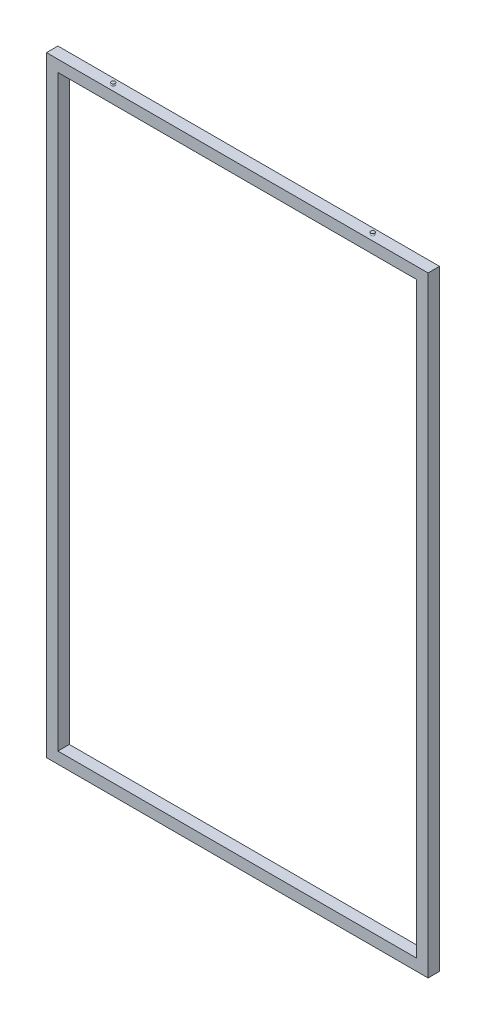
ISO-10303-21;
HEADER;
FILE_DESCRIPTION(('STEP AP214'),'2;1');
FILE_NAME('part.step','',(''),(''),'','','');
FILE_SCHEMA(('AUTOMOTIVE_DESIGN { 1 0 10303 214 1 1 1 1 }'));
ENDSEC;
DATA;
#1=APPLICATION_CONTEXT('core data for automotive mechanical design processes');
#2=APPLICATION_PROTOCOL_DEFINITION('international standard','automotive_design',2000,#1);
#3=PRODUCT_CONTEXT('',#1,'mechanical');
#4=PRODUCT('Part','Part','',(#3));
#5=PRODUCT_RELATED_PRODUCT_CATEGORY('part','',(#4));
#6=PRODUCT_DEFINITION_FORMATION('','',#4);
#7=PRODUCT_DEFINITION_CONTEXT('part definition',#1,'design');
#8=PRODUCT_DEFINITION('design','',#6,#7);
#9=PRODUCT_DEFINITION_SHAPE('','',#8);
#10=(LENGTH_UNIT() NAMED_UNIT(*) SI_UNIT(.MILLI.,.METRE.));
#11=(NAMED_UNIT(*) PLANE_ANGLE_UNIT() SI_UNIT($,.RADIAN.));
#12=(NAMED_UNIT(*) SI_UNIT($,.STERADIAN.) SOLID_ANGLE_UNIT());
#13=UNCERTAINTY_MEASURE_WITH_UNIT(LENGTH_MEASURE(1.E-05),#10,'distance_accuracy_value','');
#14=(GEOMETRIC_REPRESENTATION_CONTEXT(3) GLOBAL_UNCERTAINTY_ASSIGNED_CONTEXT((#13)) GLOBAL_UNIT_ASSIGNED_CONTEXT((#10,
#11,#12)) REPRESENTATION_CONTEXT('',''));
#15=CARTESIAN_POINT('',(0.,0.,0.));
#16=DIRECTION('',(0.,0.,1.));
#17=DIRECTION('',(1.,0.,0.));
#18=AXIS2_PLACEMENT_3D('',#15,#16,#17);
#19=CARTESIAN_POINT('',(0.,0.,15.));
#20=DIRECTION('',(0.,0.,1.));
#21=DIRECTION('',(1.,0.,0.));
#22=AXIS2_PLACEMENT_3D('',#19,#20,#21);
#23=PLANE('',#22);
#24=DIRECTION('',(0.,1.,0.));
#25=VECTOR('',#24,1.);
#26=CARTESIAN_POINT('',(500.,800.,15.));
#27=LINE('',#26,#25);
#28=CARTESIAN_POINT('',(500.,-800.,15.));
#29=VERTEX_POINT('',#28);
#30=CARTESIAN_POINT('',(500.,800.,15.));
#31=VERTEX_POINT('',#30);
#32=EDGE_CURVE('E299',#29,#31,#27,.T.);
#33=ORIENTED_EDGE('',*,*,#32,.T.);
#34=DIRECTION('',(-1.,0.,0.));
#35=VECTOR('',#34,1.);
#36=CARTESIAN_POINT('',(-500.,800.,15.));
#37=LINE('',#36,#35);
#38=CARTESIAN_POINT('',(-500.,800.,15.));
#39=VERTEX_POINT('',#38);
#40=EDGE_CURVE('E302',#31,#39,#37,.T.);
#41=ORIENTED_EDGE('',*,*,#40,.T.);
#42=DIRECTION('',(0.,-1.,0.));
#43=VECTOR('',#42,1.);
#44=CARTESIAN_POINT('',(-500.,800.,15.));
#45=LINE('',#44,#43);
#46=CARTESIAN_POINT('',(-500.,-800.,15.));
#47=VERTEX_POINT('',#46);
#48=EDGE_CURVE('E305',#39,#47,#45,.T.);
#49=ORIENTED_EDGE('',*,*,#48,.T.);
#50=DIRECTION('',(1.,0.,0.));
#51=VECTOR('',#50,1.);
#52=CARTESIAN_POINT('',(-500.,-800.,15.));
#53=LINE('',#52,#51);
#54=EDGE_CURVE('E307',#47,#29,#53,.T.);
#55=ORIENTED_EDGE('',*,*,#54,.T.);
#56=EDGE_LOOP('',(#33,#41,#49,#55));
#57=FACE_BOUND('',#56,.T.);
#58=DIRECTION('',(1.,0.,0.));
#59=VECTOR('',#58,1.);
#60=CARTESIAN_POINT('',(-470.,-770.,15.));
#61=LINE('',#60,#59);
#62=CARTESIAN_POINT('',(-470.,-770.,15.));
#63=VERTEX_POINT('',#62);
#64=CARTESIAN_POINT('',(470.,-770.,15.));
#65=VERTEX_POINT('',#64);
#66=EDGE_CURVE('E277',#63,#65,#61,.T.);
#67=ORIENTED_EDGE('',*,*,#66,.F.);
#68=DIRECTION('',(0.,-1.,0.));
#69=VECTOR('',#68,1.);
#70=CARTESIAN_POINT('',(-470.,770.,15.));
#71=LINE('',#70,#69);
#72=CARTESIAN_POINT('',(-470.,770.,15.));
#73=VERTEX_POINT('',#72);
#74=EDGE_CURVE('E275',#73,#63,#71,.T.);
#75=ORIENTED_EDGE('',*,*,#74,.F.);
#76=DIRECTION('',(-1.,0.,0.));
#77=VECTOR('',#76,1.);
#78=CARTESIAN_POINT('',(-470.,770.,15.));
#79=LINE('',#78,#77);
#80=CARTESIAN_POINT('',(470.,770.,15.));
#81=VERTEX_POINT('',#80);
#82=EDGE_CURVE('E282',#81,#73,#79,.T.);
#83=ORIENTED_EDGE('',*,*,#82,.F.);
#84=DIRECTION('',(0.,1.,0.));
#85=VECTOR('',#84,1.);
#86=CARTESIAN_POINT('',(470.,770.,15.));
#87=LINE('',#86,#85);
#88=EDGE_CURVE('E280',#65,#81,#87,.T.);
#89=ORIENTED_EDGE('',*,*,#88,.F.);
#90=EDGE_LOOP('',(#67,#75,#83,#89));
#91=FACE_BOUND('',#90,.T.);
#92=ADVANCED_FACE('F36',(#57,#91),#23,.T.);
#93=CARTESIAN_POINT('',(0.,0.,-15.));
#94=DIRECTION('',(0.,0.,1.));
#95=DIRECTION('',(1.,0.,0.));
#96=AXIS2_PLACEMENT_3D('',#93,#94,#95);
#97=PLANE('',#96);
#98=DIRECTION('',(0.,1.,0.));
#99=VECTOR('',#98,1.);
#100=CARTESIAN_POINT('',(500.,800.,-15.));
#101=LINE('',#100,#99);
#102=CARTESIAN_POINT('',(500.,-800.,-15.));
#103=VERTEX_POINT('',#102);
#104=CARTESIAN_POINT('',(500.,800.,-15.));
#105=VERTEX_POINT('',#104);
#106=EDGE_CURVE('E298',#103,#105,#101,.T.);
#107=ORIENTED_EDGE('',*,*,#106,.F.);
#108=DIRECTION('',(1.,0.,0.));
#109=VECTOR('',#108,1.);
#110=CARTESIAN_POINT('',(-500.,-800.,-15.));
#111=LINE('',#110,#109);
#112=CARTESIAN_POINT('',(-500.,-800.,-15.));
#113=VERTEX_POINT('',#112);
#114=EDGE_CURVE('E303',#113,#103,#111,.T.);
#115=ORIENTED_EDGE('',*,*,#114,.F.);
#116=DIRECTION('',(0.,-1.,0.));
#117=VECTOR('',#116,1.);
#118=CARTESIAN_POINT('',(-500.,800.,-15.));
#119=LINE('',#118,#117);
#120=CARTESIAN_POINT('',(-500.,800.,-15.));
#121=VERTEX_POINT('',#120);
#122=EDGE_CURVE('E314',#121,#113,#119,.T.);
#123=ORIENTED_EDGE('',*,*,#122,.F.);
#124=DIRECTION('',(-1.,0.,0.));
#125=VECTOR('',#124,1.);
#126=CARTESIAN_POINT('',(-500.,800.,-15.));
#127=LINE('',#126,#125);
#128=EDGE_CURVE('E312',#105,#121,#127,.T.);
#129=ORIENTED_EDGE('',*,*,#128,.F.);
#130=EDGE_LOOP('',(#107,#115,#123,#129));
#131=FACE_BOUND('',#130,.T.);
#132=DIRECTION('',(0.,-1.,0.));
#133=VECTOR('',#132,1.);
#134=CARTESIAN_POINT('',(-470.,770.,-15.));
#135=LINE('',#134,#133);
#136=CARTESIAN_POINT('',(-470.,770.,-15.));
#137=VERTEX_POINT('',#136);
#138=CARTESIAN_POINT('',(-470.,-770.,-15.));
#139=VERTEX_POINT('',#138);
#140=EDGE_CURVE('E59',#137,#139,#135,.T.);
#141=ORIENTED_EDGE('',*,*,#140,.T.);
#142=DIRECTION('',(1.,0.,0.));
#143=VECTOR('',#142,1.);
#144=CARTESIAN_POINT('',(-470.,-770.,-15.));
#145=LINE('',#144,#143);
#146=CARTESIAN_POINT('',(470.,-770.,-15.));
#147=VERTEX_POINT('',#146);
#148=EDGE_CURVE('E203',#139,#147,#145,.T.);
#149=ORIENTED_EDGE('',*,*,#148,.T.);
#150=DIRECTION('',(0.,1.,0.));
#151=VECTOR('',#150,1.);
#152=CARTESIAN_POINT('',(470.,770.,-15.));
#153=LINE('',#152,#151);
#154=CARTESIAN_POINT('',(470.,770.,-15.));
#155=VERTEX_POINT('',#154);
#156=EDGE_CURVE('E287',#147,#155,#153,.T.);
#157=ORIENTED_EDGE('',*,*,#156,.T.);
#158=DIRECTION('',(-1.,0.,0.));
#159=VECTOR('',#158,1.);
#160=CARTESIAN_POINT('',(-470.,770.,-15.));
#161=LINE('',#160,#159);
#162=EDGE_CURVE('E278',#155,#137,#161,.T.);
#163=ORIENTED_EDGE('',*,*,#162,.T.);
#164=EDGE_LOOP('',(#141,#149,#157,#163));
#165=FACE_BOUND('',#164,.T.);
#166=ADVANCED_FACE('F332',(#131,#165),#97,.F.);
#167=CARTESIAN_POINT('',(500.,800.,15.));
#168=DIRECTION('',(-1.,0.,0.));
#169=DIRECTION('',(0.,-1.,0.));
#170=AXIS2_PLACEMENT_3D('',#167,#168,#169);
#171=PLANE('',#170);
#172=ORIENTED_EDGE('',*,*,#106,.T.);
#173=DIRECTION('',(0.,0.,-1.));
#174=VECTOR('',#173,1.);
#175=CARTESIAN_POINT('',(500.,800.,15.));
#176=LINE('',#175,#174);
#177=EDGE_CURVE('E11',#31,#105,#176,.T.);
#178=ORIENTED_EDGE('',*,*,#177,.F.);
#179=ORIENTED_EDGE('',*,*,#32,.F.);
#180=DIRECTION('',(0.,0.,-1.));
#181=VECTOR('',#180,1.);
#182=CARTESIAN_POINT('',(500.,-800.,15.));
#183=LINE('',#182,#181);
#184=EDGE_CURVE('E309',#29,#103,#183,.T.);
#185=ORIENTED_EDGE('',*,*,#184,.T.);
#186=EDGE_LOOP('',(#172,#178,#179,#185));
#187=FACE_BOUND('',#186,.T.);
#188=ADVANCED_FACE('F38',(#187),#171,.F.);
#189=CARTESIAN_POINT('',(-500.,800.,15.));
#190=DIRECTION('',(0.,-1.,0.));
#191=DIRECTION('',(0.,0.,-1.));
#192=AXIS2_PLACEMENT_3D('',#189,#190,#191);
#193=PLANE('',#192);
#194=CARTESIAN_POINT('',(340.,800.,0.));
#195=DIRECTION('',(0.,1.,0.));
#196=DIRECTION('',(0.,0.,-1.));
#197=AXIS2_PLACEMENT_3D('',#194,#195,#196);
#198=CIRCLE('',#197,5.);
#199=CARTESIAN_POINT('',(340.,800.,-5.));
#200=VERTEX_POINT('',#199);
#201=EDGE_CURVE('E474',#200,#200,#198,.T.);
#202=ORIENTED_EDGE('',*,*,#201,.F.);
#203=EDGE_LOOP('',(#202));
#204=FACE_BOUND('',#203,.T.);
#205=CARTESIAN_POINT('',(-340.,800.,0.));
#206=DIRECTION('',(0.,-1.,0.));
#207=DIRECTION('',(0.,0.,-1.));
#208=AXIS2_PLACEMENT_3D('',#205,#206,#207);
#209=CIRCLE('',#208,5.);
#210=CARTESIAN_POINT('',(-340.,800.,-5.));
#211=VERTEX_POINT('',#210);
#212=EDGE_CURVE('E478',#211,#211,#209,.T.);
#213=ORIENTED_EDGE('',*,*,#212,.T.);
#214=EDGE_LOOP('',(#213));
#215=FACE_BOUND('',#214,.T.);
#216=ORIENTED_EDGE('',*,*,#128,.T.);
#217=DIRECTION('',(0.,0.,-1.));
#218=VECTOR('',#217,1.);
#219=CARTESIAN_POINT('',(-500.,800.,15.));
#220=LINE('',#219,#218);
#221=EDGE_CURVE('E44',#39,#121,#220,.T.);
#222=ORIENTED_EDGE('',*,*,#221,.F.);
#223=ORIENTED_EDGE('',*,*,#40,.F.);
#224=ORIENTED_EDGE('',*,*,#177,.T.);
#225=EDGE_LOOP('',(#216,#222,#223,#224));
#226=FACE_BOUND('',#225,.T.);
#227=ADVANCED_FACE('F343',(#204,#215,#226),#193,.F.);
#228=CARTESIAN_POINT('',(-500.,800.,15.));
#229=DIRECTION('',(1.,0.,0.));
#230=DIRECTION('',(0.,1.,0.));
#231=AXIS2_PLACEMENT_3D('',#228,#229,#230);
#232=PLANE('',#231);
#233=ORIENTED_EDGE('',*,*,#122,.T.);
#234=DIRECTION('',(0.,0.,-1.));
#235=VECTOR('',#234,1.);
#236=CARTESIAN_POINT('',(-500.,-800.,15.));
#237=LINE('',#236,#235);
#238=EDGE_CURVE('E319',#47,#113,#237,.T.);
#239=ORIENTED_EDGE('',*,*,#238,.F.);
#240=ORIENTED_EDGE('',*,*,#48,.F.);
#241=ORIENTED_EDGE('',*,*,#221,.T.);
#242=EDGE_LOOP('',(#233,#239,#240,#241));
#243=FACE_BOUND('',#242,.T.);
#244=ADVANCED_FACE('F326',(#243),#232,.F.);
#245=CARTESIAN_POINT('',(-500.,-800.,15.));
#246=DIRECTION('',(0.,1.,0.));
#247=DIRECTION('',(0.,0.,1.));
#248=AXIS2_PLACEMENT_3D('',#245,#246,#247);
#249=PLANE('',#248);
#250=ORIENTED_EDGE('',*,*,#114,.T.);
#251=ORIENTED_EDGE('',*,*,#184,.F.);
#252=ORIENTED_EDGE('',*,*,#54,.F.);
#253=ORIENTED_EDGE('',*,*,#238,.T.);
#254=EDGE_LOOP('',(#250,#251,#252,#253));
#255=FACE_BOUND('',#254,.T.);
#256=ADVANCED_FACE('F336',(#255),#249,.F.);
#257=CARTESIAN_POINT('',(-470.,770.,15.));
#258=DIRECTION('',(1.,0.,0.));
#259=DIRECTION('',(0.,1.,0.));
#260=AXIS2_PLACEMENT_3D('',#257,#258,#259);
#261=PLANE('',#260);
#262=ORIENTED_EDGE('',*,*,#140,.F.);
#263=DIRECTION('',(0.,0.,-1.));
#264=VECTOR('',#263,1.);
#265=CARTESIAN_POINT('',(-470.,770.,15.));
#266=LINE('',#265,#264);
#267=EDGE_CURVE('E283',#73,#137,#266,.T.);
#268=ORIENTED_EDGE('',*,*,#267,.F.);
#269=ORIENTED_EDGE('',*,*,#74,.T.);
#270=DIRECTION('',(0.,0.,-1.));
#271=VECTOR('',#270,1.);
#272=CARTESIAN_POINT('',(-470.,-770.,15.));
#273=LINE('',#272,#271);
#274=EDGE_CURVE('E296',#63,#139,#273,.T.);
#275=ORIENTED_EDGE('',*,*,#274,.T.);
#276=EDGE_LOOP('',(#262,#268,#269,#275));
#277=FACE_BOUND('',#276,.T.);
#278=ADVANCED_FACE('F360',(#277),#261,.T.);
#279=CARTESIAN_POINT('',(-470.,-770.,15.));
#280=DIRECTION('',(0.,1.,0.));
#281=DIRECTION('',(0.,0.,1.));
#282=AXIS2_PLACEMENT_3D('',#279,#280,#281);
#283=PLANE('',#282);
#284=ORIENTED_EDGE('',*,*,#148,.F.);
#285=ORIENTED_EDGE('',*,*,#274,.F.);
#286=ORIENTED_EDGE('',*,*,#66,.T.);
#287=DIRECTION('',(0.,0.,-1.));
#288=VECTOR('',#287,1.);
#289=CARTESIAN_POINT('',(470.,-770.,15.));
#290=LINE('',#289,#288);
#291=EDGE_CURVE('E294',#65,#147,#290,.T.);
#292=ORIENTED_EDGE('',*,*,#291,.T.);
#293=EDGE_LOOP('',(#284,#285,#286,#292));
#294=FACE_BOUND('',#293,.T.);
#295=ADVANCED_FACE('F367',(#294),#283,.T.);
#296=CARTESIAN_POINT('',(470.,770.,15.));
#297=DIRECTION('',(-1.,0.,0.));
#298=DIRECTION('',(0.,-1.,0.));
#299=AXIS2_PLACEMENT_3D('',#296,#297,#298);
#300=PLANE('',#299);
#301=ORIENTED_EDGE('',*,*,#156,.F.);
#302=ORIENTED_EDGE('',*,*,#291,.F.);
#303=ORIENTED_EDGE('',*,*,#88,.T.);
#304=DIRECTION('',(0.,0.,-1.));
#305=VECTOR('',#304,1.);
#306=CARTESIAN_POINT('',(470.,770.,15.));
#307=LINE('',#306,#305);
#308=EDGE_CURVE('E51',#81,#155,#307,.T.);
#309=ORIENTED_EDGE('',*,*,#308,.T.);
#310=EDGE_LOOP('',(#301,#302,#303,#309));
#311=FACE_BOUND('',#310,.T.);
#312=ADVANCED_FACE('F371',(#311),#300,.T.);
#313=CARTESIAN_POINT('',(-470.,770.,15.));
#314=DIRECTION('',(0.,-1.,0.));
#315=DIRECTION('',(0.,0.,-1.));
#316=AXIS2_PLACEMENT_3D('',#313,#314,#315);
#317=PLANE('',#316);
#318=ORIENTED_EDGE('',*,*,#162,.F.);
#319=ORIENTED_EDGE('',*,*,#308,.F.);
#320=ORIENTED_EDGE('',*,*,#82,.T.);
#321=ORIENTED_EDGE('',*,*,#267,.T.);
#322=EDGE_LOOP('',(#318,#319,#320,#321));
#323=FACE_BOUND('',#322,.T.);
#324=ADVANCED_FACE('F376',(#323),#317,.T.);
#325=CARTESIAN_POINT('',(-345.,805.,0.));
#326=DIRECTION('',(0.,-1.,0.));
#327=DIRECTION('',(0.,0.,-1.));
#328=AXIS2_PLACEMENT_3D('',#325,#326,#327);
#329=PLANE('',#328);
#330=CARTESIAN_POINT('',(-340.,805.,0.));
#331=DIRECTION('',(0.,-1.,0.));
#332=DIRECTION('',(0.,0.,-1.));
#333=AXIS2_PLACEMENT_3D('',#330,#331,#332);
#334=CIRCLE('',#333,5.);
#335=CARTESIAN_POINT('',(-340.,805.,-5.));
#336=VERTEX_POINT('',#335);
#337=EDGE_CURVE('E267',#336,#336,#334,.T.);
#338=ORIENTED_EDGE('',*,*,#337,.F.);
#339=EDGE_LOOP('',(#338));
#340=FACE_BOUND('',#339,.T.);
#341=ADVANCED_FACE('F382',(#340),#329,.F.);
#342=CARTESIAN_POINT('',(-340.,802.5,0.));
#343=DIRECTION('',(0.,-1.,0.));
#344=DIRECTION('',(0.,0.,-1.));
#345=AXIS2_PLACEMENT_3D('',#342,#343,#344);
#346=TOROIDAL_SURFACE('',#345,5.,2.49999999999995);
#347=ORIENTED_EDGE('',*,*,#212,.F.);
#348=EDGE_LOOP('',(#347));
#349=FACE_BOUND('',#348,.T.);
#350=ORIENTED_EDGE('',*,*,#337,.T.);
#351=EDGE_LOOP('',(#350));
#352=FACE_BOUND('',#351,.T.);
#353=ADVANCED_FACE('F458',(#349,#352),#346,.F.);
#354=CARTESIAN_POINT('',(345.,805.,0.));
#355=DIRECTION('',(0.,-1.,0.));
#356=DIRECTION('',(0.,0.,-1.));
#357=AXIS2_PLACEMENT_3D('',#354,#355,#356);
#358=PLANE('',#357);
#359=CARTESIAN_POINT('',(340.,805.,0.));
#360=DIRECTION('',(0.,1.,0.));
#361=DIRECTION('',(0.,0.,-1.));
#362=AXIS2_PLACEMENT_3D('',#359,#360,#361);
#363=CIRCLE('',#362,5.);
#364=CARTESIAN_POINT('',(340.,805.,-5.));
#365=VERTEX_POINT('',#364);
#366=EDGE_CURVE('E477',#365,#365,#363,.T.);
#367=ORIENTED_EDGE('',*,*,#366,.T.);
#368=EDGE_LOOP('',(#367));
#369=FACE_BOUND('',#368,.T.);
#370=ADVANCED_FACE('F462',(#369),#358,.F.);
#371=CARTESIAN_POINT('',(340.,802.5,0.));
#372=DIRECTION('',(0.,-1.,0.));
#373=DIRECTION('',(0.,0.,-1.));
#374=AXIS2_PLACEMENT_3D('',#371,#372,#373);
#375=TOROIDAL_SURFACE('',#374,5.,2.49999999999995);
#376=ORIENTED_EDGE('',*,*,#201,.T.);
#377=EDGE_LOOP('',(#376));
#378=FACE_BOUND('',#377,.T.);
#379=ORIENTED_EDGE('',*,*,#366,.F.);
#380=EDGE_LOOP('',(#379));
#381=FACE_BOUND('',#380,.T.);
#382=ADVANCED_FACE('F466',(#378,#381),#375,.F.);
#383=CLOSED_SHELL('',(#92,#166,#188,#227,#244,#256,#278,#295,#312,#324,#341,#353,#370,#382));
#384=CARTESIAN_POINT('',(-498.,-799.4,13.));
#385=DIRECTION('',(0.,0.,1.));
#386=DIRECTION('',(1.,0.,0.));
#387=AXIS2_PLACEMENT_3D('',#384,#385,#386);
#388=PLANE('',#387);
#389=DIRECTION('',(0.,1.,0.));
#390=VECTOR('',#389,1.);
#391=CARTESIAN_POINT('',(-472.,-799.4,13.));
#392=LINE('',#391,#390);
#393=CARTESIAN_POINT('',(-472.,-772.,13.));
#394=VERTEX_POINT('',#393);
#395=CARTESIAN_POINT('',(-472.,772.,13.));
#396=VERTEX_POINT('',#395);
#397=EDGE_CURVE('E236',#394,#396,#392,.T.);
#398=ORIENTED_EDGE('',*,*,#397,.F.);
#399=DIRECTION('',(-0.707106781186548,-0.707106781186548,0.));
#400=VECTOR('',#399,1.);
#401=CARTESIAN_POINT('',(0.700000000000089,-299.3,13.));
#402=LINE('',#401,#400);
#403=CARTESIAN_POINT('',(-498.,-798.,13.));
#404=VERTEX_POINT('',#403);
#405=EDGE_CURVE('E214',#394,#404,#402,.T.);
#406=ORIENTED_EDGE('',*,*,#405,.T.);
#407=DIRECTION('',(0.,1.,0.));
#408=VECTOR('',#407,1.);
#409=CARTESIAN_POINT('',(-498.,-799.4,13.));
#410=LINE('',#409,#408);
#411=CARTESIAN_POINT('',(-498.,798.,13.));
#412=VERTEX_POINT('',#411);
#413=EDGE_CURVE('E263',#404,#412,#410,.T.);
#414=ORIENTED_EDGE('',*,*,#413,.T.);
#415=DIRECTION('',(-0.707106781186548,0.707106781186548,0.));
#416=VECTOR('',#415,1.);
#417=CARTESIAN_POINT('',(-498.7,798.7,13.));
#418=LINE('',#417,#416);
#419=EDGE_CURVE('E243',#396,#412,#418,.T.);
#420=ORIENTED_EDGE('',*,*,#419,.F.);
#421=EDGE_LOOP('',(#398,#406,#414,#420));
#422=FACE_BOUND('',#421,.T.);
#423=ADVANCED_FACE('F383',(#422),#388,.F.);
#424=CARTESIAN_POINT('',(-498.,-799.4,13.));
#425=DIRECTION('',(-1.,0.,0.));
#426=DIRECTION('',(0.,0.,1.));
#427=AXIS2_PLACEMENT_3D('',#424,#425,#426);
#428=PLANE('',#427);
#429=ORIENTED_EDGE('',*,*,#413,.F.);
#430=DIRECTION('',(0.,0.,-1.));
#431=VECTOR('',#430,1.);
#432=CARTESIAN_POINT('',(-498.,-798.,13.));
#433=LINE('',#432,#431);
#434=CARTESIAN_POINT('',(-498.,-798.,-13.));
#435=VERTEX_POINT('',#434);
#436=EDGE_CURVE('E211',#404,#435,#433,.T.);
#437=ORIENTED_EDGE('',*,*,#436,.T.);
#438=DIRECTION('',(0.,1.,0.));
#439=VECTOR('',#438,1.);
#440=CARTESIAN_POINT('',(-498.,-799.4,-13.));
#441=LINE('',#440,#439);
#442=CARTESIAN_POINT('',(-498.,798.,-13.));
#443=VERTEX_POINT('',#442);
#444=EDGE_CURVE('E266',#435,#443,#441,.T.);
#445=ORIENTED_EDGE('',*,*,#444,.T.);
#446=DIRECTION('',(0.,0.,-1.));
#447=VECTOR('',#446,1.);
#448=CARTESIAN_POINT('',(-498.,798.,13.));
#449=LINE('',#448,#447);
#450=EDGE_CURVE('E245',#412,#443,#449,.T.);
#451=ORIENTED_EDGE('',*,*,#450,.F.);
#452=EDGE_LOOP('',(#429,#437,#445,#451));
#453=FACE_BOUND('',#452,.T.);
#454=ADVANCED_FACE('F386',(#453),#428,.F.);
#455=CARTESIAN_POINT('',(-498.,-799.4,-13.));
#456=DIRECTION('',(0.,0.,-1.));
#457=DIRECTION('',(-1.,0.,0.));
#458=AXIS2_PLACEMENT_3D('',#455,#456,#457);
#459=PLANE('',#458);
#460=ORIENTED_EDGE('',*,*,#444,.F.);
#461=DIRECTION('',(0.707106781186548,0.707106781186548,0.));
#462=VECTOR('',#461,1.);
#463=CARTESIAN_POINT('',(0.700000000000089,-299.3,-13.));
#464=LINE('',#463,#462);
#465=CARTESIAN_POINT('',(-472.,-772.,-13.));
#466=VERTEX_POINT('',#465);
#467=EDGE_CURVE('E196',#435,#466,#464,.T.);
#468=ORIENTED_EDGE('',*,*,#467,.T.);
#469=DIRECTION('',(0.,1.,0.));
#470=VECTOR('',#469,1.);
#471=CARTESIAN_POINT('',(-472.,-799.4,-13.));
#472=LINE('',#471,#470);
#473=CARTESIAN_POINT('',(-472.,772.,-13.));
#474=VERTEX_POINT('',#473);
#475=EDGE_CURVE('E270',#466,#474,#472,.T.);
#476=ORIENTED_EDGE('',*,*,#475,.T.);
#477=DIRECTION('',(0.707106781186548,-0.707106781186548,0.));
#478=VECTOR('',#477,1.);
#479=CARTESIAN_POINT('',(-498.7,798.7,-13.));
#480=LINE('',#479,#478);
#481=EDGE_CURVE('E247',#443,#474,#480,.T.);
#482=ORIENTED_EDGE('',*,*,#481,.F.);
#483=EDGE_LOOP('',(#460,#468,#476,#482));
#484=FACE_BOUND('',#483,.T.);
#485=ADVANCED_FACE('F391',(#484),#459,.F.);
#486=CARTESIAN_POINT('',(-472.,-799.4,13.));
#487=DIRECTION('',(1.,0.,0.));
#488=DIRECTION('',(0.,0.,-1.));
#489=AXIS2_PLACEMENT_3D('',#486,#487,#488);
#490=PLANE('',#489);
#491=ORIENTED_EDGE('',*,*,#475,.F.);
#492=DIRECTION('',(0.,0.,1.));
#493=VECTOR('',#492,1.);
#494=CARTESIAN_POINT('',(-472.,-772.,13.));
#495=LINE('',#494,#493);
#496=EDGE_CURVE('E217',#466,#394,#495,.T.);
#497=ORIENTED_EDGE('',*,*,#496,.T.);
#498=ORIENTED_EDGE('',*,*,#397,.T.);
#499=DIRECTION('',(0.,0.,1.));
#500=VECTOR('',#499,1.);
#501=CARTESIAN_POINT('',(-472.,772.,13.));
#502=LINE('',#501,#500);
#503=EDGE_CURVE('E222',#474,#396,#502,.T.);
#504=ORIENTED_EDGE('',*,*,#503,.F.);
#505=EDGE_LOOP('',(#491,#497,#498,#504));
#506=FACE_BOUND('',#505,.T.);
#507=ADVANCED_FACE('F395',(#506),#490,.F.);
#508=CARTESIAN_POINT('',(-499.4,772.,13.));
#509=DIRECTION('',(0.,-1.,0.));
#510=DIRECTION('',(0.,0.,-1.));
#511=AXIS2_PLACEMENT_3D('',#508,#509,#510);
#512=PLANE('',#511);
#513=ORIENTED_EDGE('',*,*,#503,.T.);
#514=DIRECTION('',(1.,0.,0.));
#515=VECTOR('',#514,1.);
#516=CARTESIAN_POINT('',(-499.4,772.,13.));
#517=LINE('',#516,#515);
#518=CARTESIAN_POINT('',(0.,772.,13.));
#519=VERTEX_POINT('',#518);
#520=EDGE_CURVE('E233',#396,#519,#517,.T.);
#521=ORIENTED_EDGE('',*,*,#520,.T.);
#522=DIRECTION('',(0.,0.,-1.));
#523=VECTOR('',#522,1.);
#524=CARTESIAN_POINT('',(0.,772.,13.));
#525=LINE('',#524,#523);
#526=CARTESIAN_POINT('',(0.,772.,-13.));
#527=VERTEX_POINT('',#526);
#528=EDGE_CURVE('E182',#519,#527,#525,.T.);
#529=ORIENTED_EDGE('',*,*,#528,.T.);
#530=DIRECTION('',(1.,0.,0.));
#531=VECTOR('',#530,1.);
#532=CARTESIAN_POINT('',(-499.4,772.,-13.));
#533=LINE('',#532,#531);
#534=EDGE_CURVE('E235',#474,#527,#533,.T.);
#535=ORIENTED_EDGE('',*,*,#534,.F.);
#536=EDGE_LOOP('',(#513,#521,#529,#535));
#537=FACE_BOUND('',#536,.T.);
#538=ADVANCED_FACE('F399',(#537),#512,.F.);
#539=CARTESIAN_POINT('',(-499.4,798.,-13.));
#540=DIRECTION('',(0.,0.,-1.));
#541=DIRECTION('',(0.,1.,0.));
#542=AXIS2_PLACEMENT_3D('',#539,#540,#541);
#543=PLANE('',#542);
#544=ORIENTED_EDGE('',*,*,#481,.T.);
#545=ORIENTED_EDGE('',*,*,#534,.T.);
#546=DIRECTION('',(0.,1.,0.));
#547=VECTOR('',#546,1.);
#548=CARTESIAN_POINT('',(0.,798.,-13.));
#549=LINE('',#548,#547);
#550=CARTESIAN_POINT('',(0.,798.,-13.));
#551=VERTEX_POINT('',#550);
#552=EDGE_CURVE('E250',#527,#551,#549,.T.);
#553=ORIENTED_EDGE('',*,*,#552,.T.);
#554=DIRECTION('',(1.,0.,0.));
#555=VECTOR('',#554,1.);
#556=CARTESIAN_POINT('',(-499.4,798.,-13.));
#557=LINE('',#556,#555);
#558=EDGE_CURVE('E238',#443,#551,#557,.T.);
#559=ORIENTED_EDGE('',*,*,#558,.F.);
#560=EDGE_LOOP('',(#544,#545,#553,#559));
#561=FACE_BOUND('',#560,.T.);
#562=ADVANCED_FACE('F417',(#561),#543,.F.);
#563=CARTESIAN_POINT('',(-499.4,798.,13.));
#564=DIRECTION('',(0.,1.,0.));
#565=DIRECTION('',(0.,0.,1.));
#566=AXIS2_PLACEMENT_3D('',#563,#564,#565);
#567=PLANE('',#566);
#568=ORIENTED_EDGE('',*,*,#450,.T.);
#569=ORIENTED_EDGE('',*,*,#558,.T.);
#570=DIRECTION('',(0.,0.,1.));
#571=VECTOR('',#570,1.);
#572=CARTESIAN_POINT('',(0.,798.,13.));
#573=LINE('',#572,#571);
#574=CARTESIAN_POINT('',(0.,798.,13.));
#575=VERTEX_POINT('',#574);
#576=EDGE_CURVE('E253',#551,#575,#573,.T.);
#577=ORIENTED_EDGE('',*,*,#576,.T.);
#578=DIRECTION('',(1.,0.,0.));
#579=VECTOR('',#578,1.);
#580=CARTESIAN_POINT('',(-499.4,798.,13.));
#581=LINE('',#580,#579);
#582=EDGE_CURVE('E240',#412,#575,#581,.T.);
#583=ORIENTED_EDGE('',*,*,#582,.F.);
#584=EDGE_LOOP('',(#568,#569,#577,#583));
#585=FACE_BOUND('',#584,.T.);
#586=ADVANCED_FACE('F421',(#585),#567,.F.);
#587=CARTESIAN_POINT('',(-499.4,798.,13.));
#588=DIRECTION('',(0.,0.,1.));
#589=DIRECTION('',(1.,0.,0.));
#590=AXIS2_PLACEMENT_3D('',#587,#588,#589);
#591=PLANE('',#590);
#592=ORIENTED_EDGE('',*,*,#419,.T.);
#593=ORIENTED_EDGE('',*,*,#582,.T.);
#594=DIRECTION('',(0.,-1.,0.));
#595=VECTOR('',#594,1.);
#596=CARTESIAN_POINT('',(0.,798.,13.));
#597=LINE('',#596,#595);
#598=EDGE_CURVE('E187',#575,#519,#597,.T.);
#599=ORIENTED_EDGE('',*,*,#598,.T.);
#600=ORIENTED_EDGE('',*,*,#520,.F.);
#601=EDGE_LOOP('',(#592,#593,#599,#600));
#602=FACE_BOUND('',#601,.T.);
#603=ADVANCED_FACE('F414',(#602),#591,.F.);
#604=CARTESIAN_POINT('',(0.,772.,13.));
#605=DIRECTION('',(0.,-1.,0.));
#606=DIRECTION('',(0.,0.,-1.));
#607=AXIS2_PLACEMENT_3D('',#604,#605,#606);
#608=PLANE('',#607);
#609=DIRECTION('',(1.,0.,0.));
#610=VECTOR('',#609,1.);
#611=CARTESIAN_POINT('',(0.,772.,-13.));
#612=LINE('',#611,#610);
#613=CARTESIAN_POINT('',(472.,772.,-13.));
#614=VERTEX_POINT('',#613);
#615=EDGE_CURVE('E186',#527,#614,#612,.T.);
#616=ORIENTED_EDGE('',*,*,#615,.F.);
#617=ORIENTED_EDGE('',*,*,#528,.F.);
#618=DIRECTION('',(1.,0.,0.));
#619=VECTOR('',#618,1.);
#620=CARTESIAN_POINT('',(0.,772.,13.));
#621=LINE('',#620,#619);
#622=CARTESIAN_POINT('',(472.,772.,13.));
#623=VERTEX_POINT('',#622);
#624=EDGE_CURVE('E178',#519,#623,#621,.T.);
#625=ORIENTED_EDGE('',*,*,#624,.T.);
#626=DIRECTION('',(0.,0.,1.));
#627=VECTOR('',#626,1.);
#628=CARTESIAN_POINT('',(472.,772.,13.));
#629=LINE('',#628,#627);
#630=EDGE_CURVE('E164',#614,#623,#629,.T.);
#631=ORIENTED_EDGE('',*,*,#630,.F.);
#632=EDGE_LOOP('',(#616,#617,#625,#631));
#633=FACE_BOUND('',#632,.T.);
#634=ADVANCED_FACE('F180',(#633),#608,.F.);
#635=CARTESIAN_POINT('',(0.,798.,-13.));
#636=DIRECTION('',(0.,0.,-1.));
#637=DIRECTION('',(0.,1.,0.));
#638=AXIS2_PLACEMENT_3D('',#635,#636,#637);
#639=PLANE('',#638);
#640=DIRECTION('',(1.,0.,0.));
#641=VECTOR('',#640,1.);
#642=CARTESIAN_POINT('',(0.,798.,-13.));
#643=LINE('',#642,#641);
#644=CARTESIAN_POINT('',(498.,798.,-13.));
#645=VERTEX_POINT('',#644);
#646=EDGE_CURVE('E259',#551,#645,#643,.T.);
#647=ORIENTED_EDGE('',*,*,#646,.F.);
#648=ORIENTED_EDGE('',*,*,#552,.F.);
#649=ORIENTED_EDGE('',*,*,#615,.T.);
#650=DIRECTION('',(-0.707106781186548,-0.707106781186548,0.));
#651=VECTOR('',#650,1.);
#652=CARTESIAN_POINT('',(498.7,798.7,-13.));
#653=LINE('',#652,#651);
#654=EDGE_CURVE('E173',#645,#614,#653,.T.);
#655=ORIENTED_EDGE('',*,*,#654,.F.);
#656=EDGE_LOOP('',(#647,#648,#649,#655));
#657=FACE_BOUND('',#656,.T.);
#658=ADVANCED_FACE('F407',(#657),#639,.F.);
#659=CARTESIAN_POINT('',(0.,798.,13.));
#660=DIRECTION('',(0.,1.,0.));
#661=DIRECTION('',(0.,0.,1.));
#662=AXIS2_PLACEMENT_3D('',#659,#660,#661);
#663=PLANE('',#662);
#664=DIRECTION('',(1.,0.,0.));
#665=VECTOR('',#664,1.);
#666=CARTESIAN_POINT('',(0.,798.,13.));
#667=LINE('',#666,#665);
#668=CARTESIAN_POINT('',(498.,798.,13.));
#669=VERTEX_POINT('',#668);
#670=EDGE_CURVE('E192',#575,#669,#667,.T.);
#671=ORIENTED_EDGE('',*,*,#670,.F.);
#672=ORIENTED_EDGE('',*,*,#576,.F.);
#673=ORIENTED_EDGE('',*,*,#646,.T.);
#674=DIRECTION('',(0.,0.,-1.));
#675=VECTOR('',#674,1.);
#676=CARTESIAN_POINT('',(498.,798.,13.));
#677=LINE('',#676,#675);
#678=EDGE_CURVE('E496',#669,#645,#677,.T.);
#679=ORIENTED_EDGE('',*,*,#678,.F.);
#680=EDGE_LOOP('',(#671,#672,#673,#679));
#681=FACE_BOUND('',#680,.T.);
#682=ADVANCED_FACE('F404',(#681),#663,.F.);
#683=CARTESIAN_POINT('',(0.,798.,13.));
#684=DIRECTION('',(0.,0.,1.));
#685=DIRECTION('',(1.,0.,0.));
#686=AXIS2_PLACEMENT_3D('',#683,#684,#685);
#687=PLANE('',#686);
#688=ORIENTED_EDGE('',*,*,#624,.F.);
#689=ORIENTED_EDGE('',*,*,#598,.F.);
#690=ORIENTED_EDGE('',*,*,#670,.T.);
#691=DIRECTION('',(0.707106781186548,0.707106781186548,0.));
#692=VECTOR('',#691,1.);
#693=CARTESIAN_POINT('',(498.7,798.7,13.));
#694=LINE('',#693,#692);
#695=EDGE_CURVE('E174',#623,#669,#694,.T.);
#696=ORIENTED_EDGE('',*,*,#695,.F.);
#697=EDGE_LOOP('',(#688,#689,#690,#696));
#698=FACE_BOUND('',#697,.T.);
#699=ADVANCED_FACE('F190',(#698),#687,.F.);
#700=CARTESIAN_POINT('',(499.4,-798.,13.));
#701=DIRECTION('',(0.,0.,1.));
#702=DIRECTION('',(1.,0.,0.));
#703=AXIS2_PLACEMENT_3D('',#700,#701,#702);
#704=PLANE('',#703);
#705=DIRECTION('',(-1.,0.,0.));
#706=VECTOR('',#705,1.);
#707=CARTESIAN_POINT('',(499.4,-772.,13.));
#708=LINE('',#707,#706);
#709=CARTESIAN_POINT('',(472.,-772.,13.));
#710=VERTEX_POINT('',#709);
#711=EDGE_CURVE('E228',#710,#394,#708,.T.);
#712=ORIENTED_EDGE('',*,*,#711,.F.);
#713=DIRECTION('',(0.707106781186548,-0.707106781186548,0.));
#714=VECTOR('',#713,1.);
#715=CARTESIAN_POINT('',(-300.7,0.699999999999923,13.));
#716=LINE('',#715,#714);
#717=CARTESIAN_POINT('',(498.,-798.,13.));
#718=VERTEX_POINT('',#717);
#719=EDGE_CURVE('E200',#710,#718,#716,.T.);
#720=ORIENTED_EDGE('',*,*,#719,.T.);
#721=DIRECTION('',(-1.,0.,0.));
#722=VECTOR('',#721,1.);
#723=CARTESIAN_POINT('',(499.4,-798.,13.));
#724=LINE('',#723,#722);
#725=EDGE_CURVE('E218',#718,#404,#724,.T.);
#726=ORIENTED_EDGE('',*,*,#725,.T.);
#727=ORIENTED_EDGE('',*,*,#405,.F.);
#728=EDGE_LOOP('',(#712,#720,#726,#727));
#729=FACE_BOUND('',#728,.T.);
#730=ADVANCED_FACE('F403',(#729),#704,.F.);
#731=CARTESIAN_POINT('',(499.4,-798.,13.));
#732=DIRECTION('',(0.,-1.,0.));
#733=DIRECTION('',(0.,0.,-1.));
#734=AXIS2_PLACEMENT_3D('',#731,#732,#733);
#735=PLANE('',#734);
#736=ORIENTED_EDGE('',*,*,#725,.F.);
#737=DIRECTION('',(0.,0.,-1.));
#738=VECTOR('',#737,1.);
#739=CARTESIAN_POINT('',(498.,-798.,13.));
#740=LINE('',#739,#738);
#741=CARTESIAN_POINT('',(498.,-798.,-13.));
#742=VERTEX_POINT('',#741);
#743=EDGE_CURVE('E491',#718,#742,#740,.T.);
#744=ORIENTED_EDGE('',*,*,#743,.T.);
#745=DIRECTION('',(-1.,0.,0.));
#746=VECTOR('',#745,1.);
#747=CARTESIAN_POINT('',(499.4,-798.,-13.));
#748=LINE('',#747,#746);
#749=EDGE_CURVE('E221',#742,#435,#748,.T.);
#750=ORIENTED_EDGE('',*,*,#749,.T.);
#751=ORIENTED_EDGE('',*,*,#436,.F.);
#752=EDGE_LOOP('',(#736,#744,#750,#751));
#753=FACE_BOUND('',#752,.T.);
#754=ADVANCED_FACE('F431',(#753),#735,.F.);
#755=CARTESIAN_POINT('',(499.4,-798.,-13.));
#756=DIRECTION('',(0.,0.,-1.));
#757=DIRECTION('',(0.,1.,0.));
#758=AXIS2_PLACEMENT_3D('',#755,#756,#757);
#759=PLANE('',#758);
#760=ORIENTED_EDGE('',*,*,#749,.F.);
#761=DIRECTION('',(-0.707106781186548,0.707106781186548,0.));
#762=VECTOR('',#761,1.);
#763=CARTESIAN_POINT('',(-300.7,0.699999999999923,-12.9999999999999));
#764=LINE('',#763,#762);
#765=CARTESIAN_POINT('',(472.,-772.,-13.));
#766=VERTEX_POINT('',#765);
#767=EDGE_CURVE('E494',#742,#766,#764,.T.);
#768=ORIENTED_EDGE('',*,*,#767,.T.);
#769=DIRECTION('',(-1.,0.,0.));
#770=VECTOR('',#769,1.);
#771=CARTESIAN_POINT('',(499.4,-772.,-13.));
#772=LINE('',#771,#770);
#773=EDGE_CURVE('E225',#766,#466,#772,.T.);
#774=ORIENTED_EDGE('',*,*,#773,.T.);
#775=ORIENTED_EDGE('',*,*,#467,.F.);
#776=EDGE_LOOP('',(#760,#768,#774,#775));
#777=FACE_BOUND('',#776,.T.);
#778=ADVANCED_FACE('F435',(#777),#759,.F.);
#779=CARTESIAN_POINT('',(499.4,-772.,13.));
#780=DIRECTION('',(0.,1.,0.));
#781=DIRECTION('',(0.,0.,1.));
#782=AXIS2_PLACEMENT_3D('',#779,#780,#781);
#783=PLANE('',#782);
#784=ORIENTED_EDGE('',*,*,#773,.F.);
#785=DIRECTION('',(0.,0.,1.));
#786=VECTOR('',#785,1.);
#787=CARTESIAN_POINT('',(472.,-772.,13.));
#788=LINE('',#787,#786);
#789=EDGE_CURVE('E486',#766,#710,#788,.T.);
#790=ORIENTED_EDGE('',*,*,#789,.T.);
#791=ORIENTED_EDGE('',*,*,#711,.T.);
#792=ORIENTED_EDGE('',*,*,#496,.F.);
#793=EDGE_LOOP('',(#784,#790,#791,#792));
#794=FACE_BOUND('',#793,.T.);
#795=ADVANCED_FACE('F439',(#794),#783,.F.);
#796=CARTESIAN_POINT('',(498.,799.4,13.));
#797=DIRECTION('',(0.,0.,1.));
#798=DIRECTION('',(1.,0.,0.));
#799=AXIS2_PLACEMENT_3D('',#796,#797,#798);
#800=PLANE('',#799);
#801=ORIENTED_EDGE('',*,*,#695,.T.);
#802=DIRECTION('',(0.,-1.,0.));
#803=VECTOR('',#802,1.);
#804=CARTESIAN_POINT('',(498.,799.4,13.));
#805=LINE('',#804,#803);
#806=EDGE_CURVE('E489',#669,#718,#805,.T.);
#807=ORIENTED_EDGE('',*,*,#806,.T.);
#808=ORIENTED_EDGE('',*,*,#719,.F.);
#809=DIRECTION('',(0.,-1.,0.));
#810=VECTOR('',#809,1.);
#811=CARTESIAN_POINT('',(472.,799.4,13.));
#812=LINE('',#811,#810);
#813=EDGE_CURVE('E168',#623,#710,#812,.T.);
#814=ORIENTED_EDGE('',*,*,#813,.F.);
#815=EDGE_LOOP('',(#801,#807,#808,#814));
#816=FACE_BOUND('',#815,.T.);
#817=ADVANCED_FACE('F198',(#816),#800,.F.);
#818=CARTESIAN_POINT('',(498.,799.4,13.));
#819=DIRECTION('',(1.,0.,0.));
#820=DIRECTION('',(0.,0.,-1.));
#821=AXIS2_PLACEMENT_3D('',#818,#819,#820);
#822=PLANE('',#821);
#823=ORIENTED_EDGE('',*,*,#678,.T.);
#824=DIRECTION('',(0.,-1.,0.));
#825=VECTOR('',#824,1.);
#826=CARTESIAN_POINT('',(498.,799.4,-13.));
#827=LINE('',#826,#825);
#828=EDGE_CURVE('E205',#645,#742,#827,.T.);
#829=ORIENTED_EDGE('',*,*,#828,.T.);
#830=ORIENTED_EDGE('',*,*,#743,.F.);
#831=ORIENTED_EDGE('',*,*,#806,.F.);
#832=EDGE_LOOP('',(#823,#829,#830,#831));
#833=FACE_BOUND('',#832,.T.);
#834=ADVANCED_FACE('F449',(#833),#822,.F.);
#835=CARTESIAN_POINT('',(498.,799.4,-13.));
#836=DIRECTION('',(0.,0.,-1.));
#837=DIRECTION('',(-1.,0.,0.));
#838=AXIS2_PLACEMENT_3D('',#835,#836,#837);
#839=PLANE('',#838);
#840=ORIENTED_EDGE('',*,*,#654,.T.);
#841=DIRECTION('',(0.,-1.,0.));
#842=VECTOR('',#841,1.);
#843=CARTESIAN_POINT('',(472.,799.4,-13.));
#844=LINE('',#843,#842);
#845=EDGE_CURVE('E170',#614,#766,#844,.T.);
#846=ORIENTED_EDGE('',*,*,#845,.T.);
#847=ORIENTED_EDGE('',*,*,#767,.F.);
#848=ORIENTED_EDGE('',*,*,#828,.F.);
#849=EDGE_LOOP('',(#840,#846,#847,#848));
#850=FACE_BOUND('',#849,.T.);
#851=ADVANCED_FACE('F446',(#850),#839,.F.);
#852=CARTESIAN_POINT('',(472.,799.4,13.));
#853=DIRECTION('',(-1.,0.,0.));
#854=DIRECTION('',(0.,0.,1.));
#855=AXIS2_PLACEMENT_3D('',#852,#853,#854);
#856=PLANE('',#855);
#857=ORIENTED_EDGE('',*,*,#630,.T.);
#858=ORIENTED_EDGE('',*,*,#813,.T.);
#859=ORIENTED_EDGE('',*,*,#789,.F.);
#860=ORIENTED_EDGE('',*,*,#845,.F.);
#861=EDGE_LOOP('',(#857,#858,#859,#860));
#862=FACE_BOUND('',#861,.T.);
#863=ADVANCED_FACE('F166',(#862),#856,.F.);
#864=CLOSED_SHELL('',(#423,#454,#485,#507,#538,#562,#586,#603,#634,#658,#682,#699,#730,#754,
#778,#795,#817,#834,#851,#863));
#865=ORIENTED_CLOSED_SHELL('',*,#864,.T.);
#866=BREP_WITH_VOIDS('B2',#383,(#865));
#867=ADVANCED_BREP_SHAPE_REPRESENTATION('',(#18,#866),#14);
#868=SHAPE_DEFINITION_REPRESENTATION(#9,#867);
ENDSEC;
END-ISO-10303-21;
